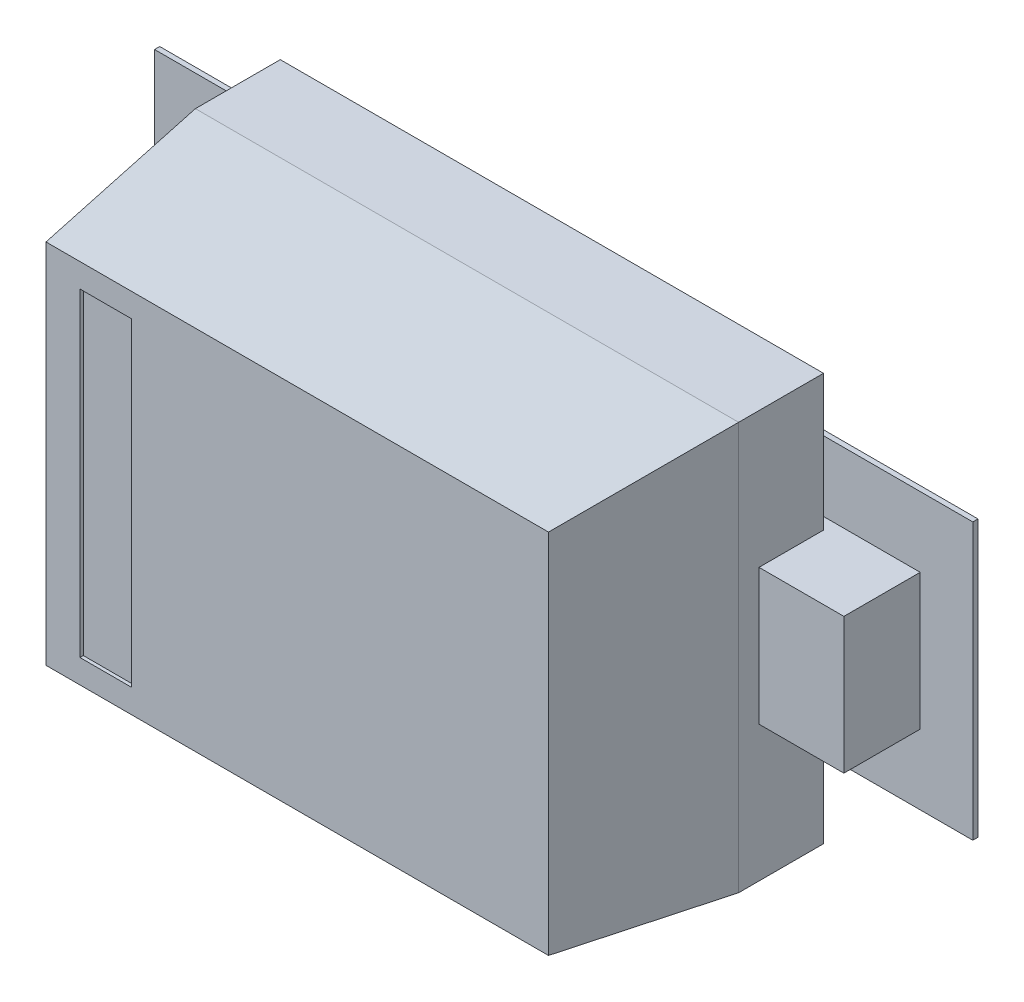
ISO-10303-21;
HEADER;
FILE_DESCRIPTION(('STEP AP214'),'2;1');
FILE_NAME('part.step','',(''),(''),'','','');
FILE_SCHEMA(('AUTOMOTIVE_DESIGN { 1 0 10303 214 1 1 1 1 }'));
ENDSEC;
DATA;
#1=APPLICATION_CONTEXT('core data for automotive mechanical design processes');
#2=APPLICATION_PROTOCOL_DEFINITION('international standard','automotive_design',2000,#1);
#3=PRODUCT_CONTEXT('',#1,'mechanical');
#4=PRODUCT('Part','Part','',(#3));
#5=PRODUCT_RELATED_PRODUCT_CATEGORY('part','',(#4));
#6=PRODUCT_DEFINITION_FORMATION('','',#4);
#7=PRODUCT_DEFINITION_CONTEXT('part definition',#1,'design');
#8=PRODUCT_DEFINITION('design','',#6,#7);
#9=PRODUCT_DEFINITION_SHAPE('','',#8);
#10=(LENGTH_UNIT() NAMED_UNIT(*) SI_UNIT(.MILLI.,.METRE.));
#11=(NAMED_UNIT(*) PLANE_ANGLE_UNIT() SI_UNIT($,.RADIAN.));
#12=(NAMED_UNIT(*) SI_UNIT($,.STERADIAN.) SOLID_ANGLE_UNIT());
#13=UNCERTAINTY_MEASURE_WITH_UNIT(LENGTH_MEASURE(1.E-05),#10,'distance_accuracy_value','');
#14=(GEOMETRIC_REPRESENTATION_CONTEXT(3) GLOBAL_UNCERTAINTY_ASSIGNED_CONTEXT((#13)) GLOBAL_UNIT_ASSIGNED_CONTEXT((#10,
#11,#12)) REPRESENTATION_CONTEXT('',''));
#15=CARTESIAN_POINT('',(0.,0.,0.));
#16=DIRECTION('',(0.,0.,1.));
#17=DIRECTION('',(1.,0.,0.));
#18=AXIS2_PLACEMENT_3D('',#15,#16,#17);
#19=CARTESIAN_POINT('',(-0.525,-0.1,0.0762));
#20=DIRECTION('',(-1.,0.,0.));
#21=DIRECTION('',(0.,0.,1.));
#22=AXIS2_PLACEMENT_3D('',#19,#20,#21);
#23=PLANE('',#22);
#24=DIRECTION('',(0.,0.,1.));
#25=VECTOR('',#24,1.);
#26=CARTESIAN_POINT('',(-0.525,-0.1,0.08382));
#27=LINE('',#26,#25);
#28=CARTESIAN_POINT('',(-0.525,-0.1,0.08382));
#29=VERTEX_POINT('',#28);
#30=CARTESIAN_POINT('',(-0.525,-0.1,0.1962));
#31=VERTEX_POINT('',#30);
#32=EDGE_CURVE('E418',#29,#31,#27,.T.);
#33=ORIENTED_EDGE('',*,*,#32,.T.);
#34=DIRECTION('',(0.,1.,0.));
#35=VECTOR('',#34,1.);
#36=CARTESIAN_POINT('',(-0.525,-0.1,0.1962));
#37=LINE('',#36,#35);
#38=CARTESIAN_POINT('',(-0.525,0.1,0.1962));
#39=VERTEX_POINT('',#38);
#40=EDGE_CURVE('E11',#31,#39,#37,.T.);
#41=ORIENTED_EDGE('',*,*,#40,.T.);
#42=DIRECTION('',(0.,0.,1.));
#43=VECTOR('',#42,1.);
#44=CARTESIAN_POINT('',(-0.525,0.1,0.08382));
#45=LINE('',#44,#43);
#46=CARTESIAN_POINT('',(-0.525,0.1,0.08382));
#47=VERTEX_POINT('',#46);
#48=EDGE_CURVE('E389',#47,#39,#45,.T.);
#49=ORIENTED_EDGE('',*,*,#48,.F.);
#50=DIRECTION('',(0.,1.,0.));
#51=VECTOR('',#50,1.);
#52=CARTESIAN_POINT('',(-0.525,-0.1,0.08382));
#53=LINE('',#52,#51);
#54=EDGE_CURVE('E437',#29,#47,#53,.T.);
#55=ORIENTED_EDGE('',*,*,#54,.F.);
#56=EDGE_LOOP('',(#33,#41,#49,#55));
#57=FACE_BOUND('',#56,.T.);
#58=ADVANCED_FACE('F17',(#57),#23,.T.);
#59=CARTESIAN_POINT('',(-0.525,-0.1,0.1962));
#60=DIRECTION('',(0.,0.,1.));
#61=DIRECTION('',(1.,0.,0.));
#62=AXIS2_PLACEMENT_3D('',#59,#60,#61);
#63=PLANE('',#62);
#64=DIRECTION('',(0.,1.,0.));
#65=VECTOR('',#64,1.);
#66=CARTESIAN_POINT('',(-0.4,-0.1,0.1962));
#67=LINE('',#66,#65);
#68=CARTESIAN_POINT('',(-0.4,-0.1,0.1962));
#69=VERTEX_POINT('',#68);
#70=CARTESIAN_POINT('',(-0.4,0.1,0.1962));
#71=VERTEX_POINT('',#70);
#72=EDGE_CURVE('E317',#69,#71,#67,.T.);
#73=ORIENTED_EDGE('',*,*,#72,.T.);
#74=DIRECTION('',(1.,0.,0.));
#75=VECTOR('',#74,1.);
#76=CARTESIAN_POINT('',(-0.525,0.1,0.1962));
#77=LINE('',#76,#75);
#78=EDGE_CURVE('E273',#39,#71,#77,.T.);
#79=ORIENTED_EDGE('',*,*,#78,.F.);
#80=ORIENTED_EDGE('',*,*,#40,.F.);
#81=DIRECTION('',(1.,0.,0.));
#82=VECTOR('',#81,1.);
#83=CARTESIAN_POINT('',(-0.525,-0.1,0.1962));
#84=LINE('',#83,#82);
#85=EDGE_CURVE('E422',#31,#69,#84,.T.);
#86=ORIENTED_EDGE('',*,*,#85,.T.);
#87=EDGE_LOOP('',(#73,#79,#80,#86));
#88=FACE_BOUND('',#87,.T.);
#89=ADVANCED_FACE('F628',(#88),#63,.T.);
#90=CARTESIAN_POINT('',(-0.325,-0.1,0.1962));
#91=DIRECTION('',(1.,0.,0.));
#92=DIRECTION('',(0.,1.,0.));
#93=AXIS2_PLACEMENT_3D('',#90,#91,#92);
#94=PLANE('',#93);
#95=DIRECTION('',(0.,0.,-1.));
#96=VECTOR('',#95,1.);
#97=CARTESIAN_POINT('',(-0.325,0.1,0.1012));
#98=LINE('',#97,#96);
#99=CARTESIAN_POINT('',(-0.325,0.1,0.1012));
#100=VERTEX_POINT('',#99);
#101=CARTESIAN_POINT('',(-0.325,0.1,0.08382));
#102=VERTEX_POINT('',#101);
#103=EDGE_CURVE('E28',#100,#102,#98,.T.);
#104=ORIENTED_EDGE('',*,*,#103,.F.);
#105=DIRECTION('',(0.,1.,0.));
#106=VECTOR('',#105,1.);
#107=CARTESIAN_POINT('',(-0.325,-0.1,0.1012));
#108=LINE('',#107,#106);
#109=CARTESIAN_POINT('',(-0.325,-0.1,0.1012));
#110=VERTEX_POINT('',#109);
#111=EDGE_CURVE('E267',#110,#100,#108,.T.);
#112=ORIENTED_EDGE('',*,*,#111,.F.);
#113=DIRECTION('',(0.,0.,-1.));
#114=VECTOR('',#113,1.);
#115=CARTESIAN_POINT('',(-0.325,-0.1,0.1012));
#116=LINE('',#115,#114);
#117=CARTESIAN_POINT('',(-0.325,-0.1,0.08382));
#118=VERTEX_POINT('',#117);
#119=EDGE_CURVE('E466',#110,#118,#116,.T.);
#120=ORIENTED_EDGE('',*,*,#119,.T.);
#121=DIRECTION('',(0.,1.,0.));
#122=VECTOR('',#121,1.);
#123=CARTESIAN_POINT('',(-0.325,-0.1,0.08382));
#124=LINE('',#123,#122);
#125=EDGE_CURVE('E268',#118,#102,#124,.T.);
#126=ORIENTED_EDGE('',*,*,#125,.T.);
#127=EDGE_LOOP('',(#104,#112,#120,#126));
#128=FACE_BOUND('',#127,.T.);
#129=ADVANCED_FACE('F264',(#128),#94,.T.);
#130=CARTESIAN_POINT('',(0.325,-0.1,0.0762));
#131=DIRECTION('',(-1.,0.,0.));
#132=DIRECTION('',(0.,0.,1.));
#133=AXIS2_PLACEMENT_3D('',#130,#131,#132);
#134=PLANE('',#133);
#135=DIRECTION('',(0.,0.,1.));
#136=VECTOR('',#135,1.);
#137=CARTESIAN_POINT('',(0.325,-0.1,0.08382));
#138=LINE('',#137,#136);
#139=CARTESIAN_POINT('',(0.325,-0.1,0.08382));
#140=VERTEX_POINT('',#139);
#141=CARTESIAN_POINT('',(0.325,-0.1,0.1012));
#142=VERTEX_POINT('',#141);
#143=EDGE_CURVE('E359',#140,#142,#138,.T.);
#144=ORIENTED_EDGE('',*,*,#143,.T.);
#145=DIRECTION('',(0.,1.,0.));
#146=VECTOR('',#145,1.);
#147=CARTESIAN_POINT('',(0.325,-0.1,0.1012));
#148=LINE('',#147,#146);
#149=CARTESIAN_POINT('',(0.325,0.1,0.1012));
#150=VERTEX_POINT('',#149);
#151=EDGE_CURVE('E506',#142,#150,#148,.T.);
#152=ORIENTED_EDGE('',*,*,#151,.T.);
#153=DIRECTION('',(0.,0.,1.));
#154=VECTOR('',#153,1.);
#155=CARTESIAN_POINT('',(0.325,0.1,0.08382));
#156=LINE('',#155,#154);
#157=CARTESIAN_POINT('',(0.325,0.1,0.08382));
#158=VERTEX_POINT('',#157);
#159=EDGE_CURVE('E312',#158,#150,#156,.T.);
#160=ORIENTED_EDGE('',*,*,#159,.F.);
#161=DIRECTION('',(0.,1.,0.));
#162=VECTOR('',#161,1.);
#163=CARTESIAN_POINT('',(0.325,-0.1,0.08382));
#164=LINE('',#163,#162);
#165=EDGE_CURVE('E377',#140,#158,#164,.T.);
#166=ORIENTED_EDGE('',*,*,#165,.F.);
#167=EDGE_LOOP('',(#144,#152,#160,#166));
#168=FACE_BOUND('',#167,.T.);
#169=ADVANCED_FACE('F640',(#168),#134,.T.);
#170=CARTESIAN_POINT('',(0.,0.1,0.));
#171=DIRECTION('',(0.,1.,0.));
#172=DIRECTION('',(1.,0.,0.));
#173=AXIS2_PLACEMENT_3D('',#170,#171,#172);
#174=PLANE('',#173);
#175=ORIENTED_EDGE('',*,*,#48,.T.);
#176=ORIENTED_EDGE('',*,*,#78,.T.);
#177=DIRECTION('',(0.,0.,1.));
#178=VECTOR('',#177,1.);
#179=CARTESIAN_POINT('',(-0.4,0.1,0.1012));
#180=LINE('',#179,#178);
#181=CARTESIAN_POINT('',(-0.4,0.1,0.1012));
#182=VERTEX_POINT('',#181);
#183=EDGE_CURVE('E280',#182,#71,#180,.T.);
#184=ORIENTED_EDGE('',*,*,#183,.F.);
#185=DIRECTION('',(1.,0.,0.));
#186=VECTOR('',#185,1.);
#187=CARTESIAN_POINT('',(-0.4,0.1,0.1012));
#188=LINE('',#187,#186);
#189=EDGE_CURVE('E276',#182,#100,#188,.T.);
#190=ORIENTED_EDGE('',*,*,#189,.T.);
#191=ORIENTED_EDGE('',*,*,#103,.T.);
#192=DIRECTION('',(-1.,0.,0.));
#193=VECTOR('',#192,1.);
#194=CARTESIAN_POINT('',(-0.325,0.1,0.08382));
#195=LINE('',#194,#193);
#196=EDGE_CURVE('E434',#102,#47,#195,.T.);
#197=ORIENTED_EDGE('',*,*,#196,.T.);
#198=EDGE_LOOP('',(#175,#176,#184,#190,#191,#197));
#199=FACE_BOUND('',#198,.T.);
#200=ADVANCED_FACE('F278',(#199),#174,.T.);
#201=CARTESIAN_POINT('',(0.,0.1,0.));
#202=DIRECTION('',(0.,1.,0.));
#203=DIRECTION('',(1.,0.,0.));
#204=AXIS2_PLACEMENT_3D('',#201,#202,#203);
#205=PLANE('',#204);
#206=ORIENTED_EDGE('',*,*,#159,.T.);
#207=DIRECTION('',(1.,0.,0.));
#208=VECTOR('',#207,1.);
#209=CARTESIAN_POINT('',(0.325,0.1,0.1012));
#210=LINE('',#209,#208);
#211=CARTESIAN_POINT('',(0.4,0.1,0.1012));
#212=VERTEX_POINT('',#211);
#213=EDGE_CURVE('E495',#150,#212,#210,.T.);
#214=ORIENTED_EDGE('',*,*,#213,.T.);
#215=DIRECTION('',(0.,0.,-1.));
#216=VECTOR('',#215,1.);
#217=CARTESIAN_POINT('',(0.4,0.1,0.1962));
#218=LINE('',#217,#216);
#219=CARTESIAN_POINT('',(0.4,0.1,0.1962));
#220=VERTEX_POINT('',#219);
#221=EDGE_CURVE('E427',#220,#212,#218,.T.);
#222=ORIENTED_EDGE('',*,*,#221,.F.);
#223=DIRECTION('',(1.,0.,0.));
#224=VECTOR('',#223,1.);
#225=CARTESIAN_POINT('',(0.4,0.1,0.1962));
#226=LINE('',#225,#224);
#227=CARTESIAN_POINT('',(0.525,0.1,0.1962));
#228=VERTEX_POINT('',#227);
#229=EDGE_CURVE('E449',#220,#228,#226,.T.);
#230=ORIENTED_EDGE('',*,*,#229,.T.);
#231=DIRECTION('',(0.,0.,-1.));
#232=VECTOR('',#231,1.);
#233=CARTESIAN_POINT('',(0.525,0.1,0.1962));
#234=LINE('',#233,#232);
#235=CARTESIAN_POINT('',(0.525,0.1,0.08382));
#236=VERTEX_POINT('',#235);
#237=EDGE_CURVE('E450',#228,#236,#234,.T.);
#238=ORIENTED_EDGE('',*,*,#237,.T.);
#239=DIRECTION('',(-1.,0.,0.));
#240=VECTOR('',#239,1.);
#241=CARTESIAN_POINT('',(0.525,0.1,0.08382));
#242=LINE('',#241,#240);
#243=EDGE_CURVE('E550',#236,#158,#242,.T.);
#244=ORIENTED_EDGE('',*,*,#243,.T.);
#245=EDGE_LOOP('',(#206,#214,#222,#230,#238,#244));
#246=FACE_BOUND('',#245,.T.);
#247=ADVANCED_FACE('F639',(#246),#205,.T.);
#248=CARTESIAN_POINT('',(0.,0.3,0.));
#249=DIRECTION('',(0.,1.,0.));
#250=DIRECTION('',(1.,0.,0.));
#251=AXIS2_PLACEMENT_3D('',#248,#249,#250);
#252=PLANE('',#251);
#253=DIRECTION('',(0.,0.,-1.));
#254=VECTOR('',#253,1.);
#255=CARTESIAN_POINT('',(0.4,0.3,0.2262));
#256=LINE('',#255,#254);
#257=CARTESIAN_POINT('',(0.4,0.3,0.2262));
#258=VERTEX_POINT('',#257);
#259=CARTESIAN_POINT('',(0.4,0.3,0.1012));
#260=VERTEX_POINT('',#259);
#261=EDGE_CURVE('E430',#258,#260,#256,.T.);
#262=ORIENTED_EDGE('',*,*,#261,.T.);
#263=DIRECTION('',(-1.,0.,0.));
#264=VECTOR('',#263,1.);
#265=CARTESIAN_POINT('',(0.4,0.3,0.1012));
#266=LINE('',#265,#264);
#267=CARTESIAN_POINT('',(-0.4,0.3,0.1012));
#268=VERTEX_POINT('',#267);
#269=EDGE_CURVE('E285',#260,#268,#266,.T.);
#270=ORIENTED_EDGE('',*,*,#269,.T.);
#271=DIRECTION('',(0.,0.,1.));
#272=VECTOR('',#271,1.);
#273=CARTESIAN_POINT('',(-0.4,0.3,0.1012));
#274=LINE('',#273,#272);
#275=CARTESIAN_POINT('',(-0.4,0.3,0.2262));
#276=VERTEX_POINT('',#275);
#277=EDGE_CURVE('E321',#268,#276,#274,.T.);
#278=ORIENTED_EDGE('',*,*,#277,.T.);
#279=DIRECTION('',(1.,0.,0.));
#280=VECTOR('',#279,1.);
#281=CARTESIAN_POINT('',(-0.4,0.3,0.2262));
#282=LINE('',#281,#280);
#283=EDGE_CURVE('E218',#276,#258,#282,.T.);
#284=ORIENTED_EDGE('',*,*,#283,.T.);
#285=EDGE_LOOP('',(#262,#270,#278,#284));
#286=FACE_BOUND('',#285,.T.);
#287=ADVANCED_FACE('F672',(#286),#252,.T.);
#288=CARTESIAN_POINT('',(0.,0.285,0.3512));
#289=DIRECTION('',(0.,0.992876838486925,0.119145220618403));
#290=DIRECTION('',(1.,0.,0.));
#291=AXIS2_PLACEMENT_3D('',#288,#289,#290);
#292=PLANE('',#291);
#293=DIRECTION('',(-0.118308451008796,0.118308451008796,-0.985903758406366));
#294=VECTOR('',#293,1.);
#295=CARTESIAN_POINT('',(-0.37,0.27,0.4762));
#296=LINE('',#295,#294);
#297=CARTESIAN_POINT('',(-0.37,0.27,0.4762));
#298=VERTEX_POINT('',#297);
#299=EDGE_CURVE('E413',#298,#276,#296,.T.);
#300=ORIENTED_EDGE('',*,*,#299,.F.);
#301=DIRECTION('',(1.,0.,0.));
#302=VECTOR('',#301,1.);
#303=CARTESIAN_POINT('',(-0.37,0.27,0.4762));
#304=LINE('',#303,#302);
#305=CARTESIAN_POINT('',(0.37,0.27,0.4762));
#306=VERTEX_POINT('',#305);
#307=EDGE_CURVE('E393',#298,#306,#304,.T.);
#308=ORIENTED_EDGE('',*,*,#307,.T.);
#309=DIRECTION('',(0.118308451008796,0.118308451008796,-0.985903758406366));
#310=VECTOR('',#309,1.);
#311=CARTESIAN_POINT('',(0.37,0.27,0.4762));
#312=LINE('',#311,#310);
#313=EDGE_CURVE('E313',#306,#258,#312,.T.);
#314=ORIENTED_EDGE('',*,*,#313,.T.);
#315=ORIENTED_EDGE('',*,*,#283,.F.);
#316=EDGE_LOOP('',(#300,#308,#314,#315));
#317=FACE_BOUND('',#316,.T.);
#318=ADVANCED_FACE('F675',(#317),#292,.T.);
#319=CARTESIAN_POINT('',(0.385,0.,0.3512));
#320=DIRECTION('',(0.992876838486925,0.,0.119145220618403));
#321=DIRECTION('',(0.,-1.,0.));
#322=AXIS2_PLACEMENT_3D('',#319,#320,#321);
#323=PLANE('',#322);
#324=ORIENTED_EDGE('',*,*,#313,.F.);
#325=DIRECTION('',(0.,-1.,0.));
#326=VECTOR('',#325,1.);
#327=CARTESIAN_POINT('',(0.37,0.27,0.4762));
#328=LINE('',#327,#326);
#329=CARTESIAN_POINT('',(0.37,-0.27,0.4762));
#330=VERTEX_POINT('',#329);
#331=EDGE_CURVE('E390',#306,#330,#328,.T.);
#332=ORIENTED_EDGE('',*,*,#331,.T.);
#333=DIRECTION('',(0.118308451008796,-0.118308451008796,-0.985903758406366));
#334=VECTOR('',#333,1.);
#335=CARTESIAN_POINT('',(0.37,-0.27,0.4762));
#336=LINE('',#335,#334);
#337=CARTESIAN_POINT('',(0.4,-0.3,0.2262));
#338=VERTEX_POINT('',#337);
#339=EDGE_CURVE('E332',#330,#338,#336,.T.);
#340=ORIENTED_EDGE('',*,*,#339,.T.);
#341=DIRECTION('',(0.,-1.,0.));
#342=VECTOR('',#341,1.);
#343=CARTESIAN_POINT('',(0.4,0.3,0.2262));
#344=LINE('',#343,#342);
#345=EDGE_CURVE('E451',#258,#338,#344,.T.);
#346=ORIENTED_EDGE('',*,*,#345,.F.);
#347=EDGE_LOOP('',(#324,#332,#340,#346));
#348=FACE_BOUND('',#347,.T.);
#349=ADVANCED_FACE('F654',(#348),#323,.T.);
#350=CARTESIAN_POINT('',(0.4,-0.3,0.4762));
#351=DIRECTION('',(1.,0.,0.));
#352=DIRECTION('',(0.,1.,0.));
#353=AXIS2_PLACEMENT_3D('',#350,#351,#352);
#354=PLANE('',#353);
#355=DIRECTION('',(0.,0.,-1.));
#356=VECTOR('',#355,1.);
#357=CARTESIAN_POINT('',(0.4,-0.3,0.2262));
#358=LINE('',#357,#356);
#359=CARTESIAN_POINT('',(0.4,-0.3,0.1012));
#360=VERTEX_POINT('',#359);
#361=EDGE_CURVE('E322',#338,#360,#358,.T.);
#362=ORIENTED_EDGE('',*,*,#361,.T.);
#363=DIRECTION('',(0.,1.,0.));
#364=VECTOR('',#363,1.);
#365=CARTESIAN_POINT('',(0.4,-0.3,0.1012));
#366=LINE('',#365,#364);
#367=CARTESIAN_POINT('',(0.4,-0.1,0.1012));
#368=VERTEX_POINT('',#367);
#369=EDGE_CURVE('E381',#360,#368,#366,.T.);
#370=ORIENTED_EDGE('',*,*,#369,.T.);
#371=DIRECTION('',(0.,0.,-1.));
#372=VECTOR('',#371,1.);
#373=CARTESIAN_POINT('',(0.4,-0.1,0.1962));
#374=LINE('',#373,#372);
#375=CARTESIAN_POINT('',(0.4,-0.1,0.1962));
#376=VERTEX_POINT('',#375);
#377=EDGE_CURVE('E363',#376,#368,#374,.T.);
#378=ORIENTED_EDGE('',*,*,#377,.F.);
#379=DIRECTION('',(0.,1.,0.));
#380=VECTOR('',#379,1.);
#381=CARTESIAN_POINT('',(0.4,-0.1,0.1962));
#382=LINE('',#381,#380);
#383=EDGE_CURVE('E431',#376,#220,#382,.T.);
#384=ORIENTED_EDGE('',*,*,#383,.T.);
#385=ORIENTED_EDGE('',*,*,#221,.T.);
#386=DIRECTION('',(0.,1.,0.));
#387=VECTOR('',#386,1.);
#388=CARTESIAN_POINT('',(0.4,0.1,0.1012));
#389=LINE('',#388,#387);
#390=EDGE_CURVE('E409',#212,#260,#389,.T.);
#391=ORIENTED_EDGE('',*,*,#390,.T.);
#392=ORIENTED_EDGE('',*,*,#261,.F.);
#393=ORIENTED_EDGE('',*,*,#345,.T.);
#394=EDGE_LOOP('',(#362,#370,#378,#384,#385,#391,#392,#393));
#395=FACE_BOUND('',#394,.T.);
#396=ADVANCED_FACE('F650',(#395),#354,.T.);
#397=CARTESIAN_POINT('',(0.325,-0.1,0.1962));
#398=DIRECTION('',(0.,0.,1.));
#399=DIRECTION('',(1.,0.,0.));
#400=AXIS2_PLACEMENT_3D('',#397,#398,#399);
#401=PLANE('',#400);
#402=DIRECTION('',(0.,1.,0.));
#403=VECTOR('',#402,1.);
#404=CARTESIAN_POINT('',(0.525,-0.1,0.1962));
#405=LINE('',#404,#403);
#406=CARTESIAN_POINT('',(0.525,-0.1,0.1962));
#407=VERTEX_POINT('',#406);
#408=EDGE_CURVE('E445',#407,#228,#405,.T.);
#409=ORIENTED_EDGE('',*,*,#408,.T.);
#410=ORIENTED_EDGE('',*,*,#229,.F.);
#411=ORIENTED_EDGE('',*,*,#383,.F.);
#412=DIRECTION('',(1.,0.,0.));
#413=VECTOR('',#412,1.);
#414=CARTESIAN_POINT('',(0.4,-0.1,0.1962));
#415=LINE('',#414,#413);
#416=EDGE_CURVE('E412',#376,#407,#415,.T.);
#417=ORIENTED_EDGE('',*,*,#416,.T.);
#418=EDGE_LOOP('',(#409,#410,#411,#417));
#419=FACE_BOUND('',#418,.T.);
#420=ADVANCED_FACE('F653',(#419),#401,.T.);
#421=CARTESIAN_POINT('',(0.525,-0.1,0.1962));
#422=DIRECTION('',(1.,0.,0.));
#423=DIRECTION('',(0.,1.,0.));
#424=AXIS2_PLACEMENT_3D('',#421,#422,#423);
#425=PLANE('',#424);
#426=ORIENTED_EDGE('',*,*,#237,.F.);
#427=ORIENTED_EDGE('',*,*,#408,.F.);
#428=DIRECTION('',(0.,0.,-1.));
#429=VECTOR('',#428,1.);
#430=CARTESIAN_POINT('',(0.525,-0.1,0.1962));
#431=LINE('',#430,#429);
#432=CARTESIAN_POINT('',(0.525,-0.1,0.08382));
#433=VERTEX_POINT('',#432);
#434=EDGE_CURVE('E380',#407,#433,#431,.T.);
#435=ORIENTED_EDGE('',*,*,#434,.T.);
#436=DIRECTION('',(0.,1.,0.));
#437=VECTOR('',#436,1.);
#438=CARTESIAN_POINT('',(0.525,-0.1,0.08382));
#439=LINE('',#438,#437);
#440=EDGE_CURVE('E474',#433,#236,#439,.T.);
#441=ORIENTED_EDGE('',*,*,#440,.T.);
#442=EDGE_LOOP('',(#426,#427,#435,#441));
#443=FACE_BOUND('',#442,.T.);
#444=ADVANCED_FACE('F537',(#443),#425,.T.);
#445=CARTESIAN_POINT('',(-0.2975102,-0.2029968,0.0762));
#446=DIRECTION('',(1.,0.,0.));
#447=DIRECTION('',(0.,1.,0.));
#448=AXIS2_PLACEMENT_3D('',#445,#446,#447);
#449=PLANE('',#448);
#450=DIRECTION('',(0.,0.,1.));
#451=VECTOR('',#450,1.);
#452=CARTESIAN_POINT('',(-0.2975102,0.2029968,0.0762));
#453=LINE('',#452,#451);
#454=CARTESIAN_POINT('',(-0.2975102,0.2029968,0.0762));
#455=VERTEX_POINT('',#454);
#456=CARTESIAN_POINT('',(-0.2975102,0.2029968,0.08382));
#457=VERTEX_POINT('',#456);
#458=EDGE_CURVE('E306',#455,#457,#453,.T.);
#459=ORIENTED_EDGE('',*,*,#458,.T.);
#460=DIRECTION('',(0.,1.,0.));
#461=VECTOR('',#460,1.);
#462=CARTESIAN_POINT('',(-0.2975102,-0.2029968,0.08382));
#463=LINE('',#462,#461);
#464=CARTESIAN_POINT('',(-0.2975102,-0.2029968,0.08382));
#465=VERTEX_POINT('',#464);
#466=EDGE_CURVE('E372',#465,#457,#463,.T.);
#467=ORIENTED_EDGE('',*,*,#466,.F.);
#468=DIRECTION('',(0.,0.,1.));
#469=VECTOR('',#468,1.);
#470=CARTESIAN_POINT('',(-0.2975102,-0.2029968,0.0762));
#471=LINE('',#470,#469);
#472=CARTESIAN_POINT('',(-0.2975102,-0.2029968,0.0762));
#473=VERTEX_POINT('',#472);
#474=EDGE_CURVE('E478',#473,#465,#471,.T.);
#475=ORIENTED_EDGE('',*,*,#474,.F.);
#476=DIRECTION('',(0.,1.,0.));
#477=VECTOR('',#476,1.);
#478=CARTESIAN_POINT('',(-0.2975102,-0.2029968,0.0762));
#479=LINE('',#478,#477);
#480=EDGE_CURVE('E351',#473,#455,#479,.T.);
#481=ORIENTED_EDGE('',*,*,#480,.T.);
#482=EDGE_LOOP('',(#459,#467,#475,#481));
#483=FACE_BOUND('',#482,.T.);
#484=ADVANCED_FACE('F709',(#483),#449,.T.);
#485=CARTESIAN_POINT('',(-0.602488,-0.2029968,0.0762));
#486=DIRECTION('',(0.,-1.,0.));
#487=DIRECTION('',(0.,0.,-1.));
#488=AXIS2_PLACEMENT_3D('',#485,#486,#487);
#489=PLANE('',#488);
#490=ORIENTED_EDGE('',*,*,#474,.T.);
#491=DIRECTION('',(1.,0.,0.));
#492=VECTOR('',#491,1.);
#493=CARTESIAN_POINT('',(-0.602488,-0.2029968,0.08382));
#494=LINE('',#493,#492);
#495=CARTESIAN_POINT('',(-0.602488,-0.2029968,0.08382));
#496=VERTEX_POINT('',#495);
#497=EDGE_CURVE('E368',#496,#465,#494,.T.);
#498=ORIENTED_EDGE('',*,*,#497,.F.);
#499=DIRECTION('',(0.,0.,1.));
#500=VECTOR('',#499,1.);
#501=CARTESIAN_POINT('',(-0.602488,-0.2029968,0.0762));
#502=LINE('',#501,#500);
#503=CARTESIAN_POINT('',(-0.602488,-0.2029968,0.0762));
#504=VERTEX_POINT('',#503);
#505=EDGE_CURVE('E481',#504,#496,#502,.T.);
#506=ORIENTED_EDGE('',*,*,#505,.F.);
#507=DIRECTION('',(1.,0.,0.));
#508=VECTOR('',#507,1.);
#509=CARTESIAN_POINT('',(-0.602488,-0.2029968,0.0762));
#510=LINE('',#509,#508);
#511=EDGE_CURVE('E498',#504,#473,#510,.T.);
#512=ORIENTED_EDGE('',*,*,#511,.T.);
#513=EDGE_LOOP('',(#490,#498,#506,#512));
#514=FACE_BOUND('',#513,.T.);
#515=ADVANCED_FACE('F679',(#514),#489,.T.);
#516=CARTESIAN_POINT('',(-0.602488,0.2029968,0.0762));
#517=DIRECTION('',(-1.,0.,0.));
#518=DIRECTION('',(0.,0.,1.));
#519=AXIS2_PLACEMENT_3D('',#516,#517,#518);
#520=PLANE('',#519);
#521=ORIENTED_EDGE('',*,*,#505,.T.);
#522=DIRECTION('',(0.,-1.,0.));
#523=VECTOR('',#522,1.);
#524=CARTESIAN_POINT('',(-0.602488,0.2029968,0.08382));
#525=LINE('',#524,#523);
#526=CARTESIAN_POINT('',(-0.602488,0.2029968,0.08382));
#527=VERTEX_POINT('',#526);
#528=EDGE_CURVE('E373',#527,#496,#525,.T.);
#529=ORIENTED_EDGE('',*,*,#528,.F.);
#530=DIRECTION('',(0.,0.,1.));
#531=VECTOR('',#530,1.);
#532=CARTESIAN_POINT('',(-0.602488,0.2029968,0.0762));
#533=LINE('',#532,#531);
#534=CARTESIAN_POINT('',(-0.602488,0.2029968,0.0762));
#535=VERTEX_POINT('',#534);
#536=EDGE_CURVE('E309',#535,#527,#533,.T.);
#537=ORIENTED_EDGE('',*,*,#536,.F.);
#538=DIRECTION('',(0.,-1.,0.));
#539=VECTOR('',#538,1.);
#540=CARTESIAN_POINT('',(-0.602488,0.2029968,0.0762));
#541=LINE('',#540,#539);
#542=EDGE_CURVE('E499',#535,#504,#541,.T.);
#543=ORIENTED_EDGE('',*,*,#542,.T.);
#544=EDGE_LOOP('',(#521,#529,#537,#543));
#545=FACE_BOUND('',#544,.T.);
#546=ADVANCED_FACE('F659',(#545),#520,.T.);
#547=CARTESIAN_POINT('',(0.2975102,0.2029968,0.0762));
#548=DIRECTION('',(-1.,0.,0.));
#549=DIRECTION('',(0.,0.,1.));
#550=AXIS2_PLACEMENT_3D('',#547,#548,#549);
#551=PLANE('',#550);
#552=DIRECTION('',(0.,0.,1.));
#553=VECTOR('',#552,1.);
#554=CARTESIAN_POINT('',(0.2975102,-0.2029968,0.0762));
#555=LINE('',#554,#553);
#556=CARTESIAN_POINT('',(0.2975102,-0.2029968,0.0762));
#557=VERTEX_POINT('',#556);
#558=CARTESIAN_POINT('',(0.2975102,-0.2029968,0.08382));
#559=VERTEX_POINT('',#558);
#560=EDGE_CURVE('E581',#557,#559,#555,.T.);
#561=ORIENTED_EDGE('',*,*,#560,.T.);
#562=DIRECTION('',(0.,-1.,0.));
#563=VECTOR('',#562,1.);
#564=CARTESIAN_POINT('',(0.2975102,0.2029968,0.08382));
#565=LINE('',#564,#563);
#566=CARTESIAN_POINT('',(0.2975102,0.2029968,0.08382));
#567=VERTEX_POINT('',#566);
#568=EDGE_CURVE('E340',#567,#559,#565,.T.);
#569=ORIENTED_EDGE('',*,*,#568,.F.);
#570=DIRECTION('',(0.,0.,1.));
#571=VECTOR('',#570,1.);
#572=CARTESIAN_POINT('',(0.2975102,0.2029968,0.0762));
#573=LINE('',#572,#571);
#574=CARTESIAN_POINT('',(0.2975102,0.2029968,0.0762));
#575=VERTEX_POINT('',#574);
#576=EDGE_CURVE('E356',#575,#567,#573,.T.);
#577=ORIENTED_EDGE('',*,*,#576,.F.);
#578=DIRECTION('',(0.,-1.,0.));
#579=VECTOR('',#578,1.);
#580=CARTESIAN_POINT('',(0.2975102,0.2029968,0.0762));
#581=LINE('',#580,#579);
#582=EDGE_CURVE('E21',#575,#557,#581,.T.);
#583=ORIENTED_EDGE('',*,*,#582,.T.);
#584=EDGE_LOOP('',(#561,#569,#577,#583));
#585=FACE_BOUND('',#584,.T.);
#586=ADVANCED_FACE('F656',(#585),#551,.T.);
#587=CARTESIAN_POINT('',(0.2975102,-0.2029968,0.0762));
#588=DIRECTION('',(0.,-1.,0.));
#589=DIRECTION('',(0.,0.,-1.));
#590=AXIS2_PLACEMENT_3D('',#587,#588,#589);
#591=PLANE('',#590);
#592=DIRECTION('',(0.,0.,1.));
#593=VECTOR('',#592,1.);
#594=CARTESIAN_POINT('',(0.602488,-0.2029968,0.0762));
#595=LINE('',#594,#593);
#596=CARTESIAN_POINT('',(0.602488,-0.2029968,0.0762));
#597=VERTEX_POINT('',#596);
#598=CARTESIAN_POINT('',(0.602488,-0.2029968,0.08382));
#599=VERTEX_POINT('',#598);
#600=EDGE_CURVE('E355',#597,#599,#595,.T.);
#601=ORIENTED_EDGE('',*,*,#600,.T.);
#602=DIRECTION('',(1.,0.,0.));
#603=VECTOR('',#602,1.);
#604=CARTESIAN_POINT('',(0.2975102,-0.2029968,0.08382));
#605=LINE('',#604,#603);
#606=EDGE_CURVE('E336',#559,#599,#605,.T.);
#607=ORIENTED_EDGE('',*,*,#606,.F.);
#608=ORIENTED_EDGE('',*,*,#560,.F.);
#609=DIRECTION('',(1.,0.,0.));
#610=VECTOR('',#609,1.);
#611=CARTESIAN_POINT('',(0.2975102,-0.2029968,0.0762));
#612=LINE('',#611,#610);
#613=EDGE_CURVE('E386',#557,#597,#612,.T.);
#614=ORIENTED_EDGE('',*,*,#613,.T.);
#615=EDGE_LOOP('',(#601,#607,#608,#614));
#616=FACE_BOUND('',#615,.T.);
#617=ADVANCED_FACE('F647',(#616),#591,.T.);
#618=CARTESIAN_POINT('',(0.602488,-0.2029968,0.0762));
#619=DIRECTION('',(1.,0.,0.));
#620=DIRECTION('',(0.,1.,0.));
#621=AXIS2_PLACEMENT_3D('',#618,#619,#620);
#622=PLANE('',#621);
#623=DIRECTION('',(0.,0.,1.));
#624=VECTOR('',#623,1.);
#625=CARTESIAN_POINT('',(0.602488,0.2029968,0.0762));
#626=LINE('',#625,#624);
#627=CARTESIAN_POINT('',(0.602488,0.2029968,0.0762));
#628=VERTEX_POINT('',#627);
#629=CARTESIAN_POINT('',(0.602488,0.2029968,0.08382));
#630=VERTEX_POINT('',#629);
#631=EDGE_CURVE('E352',#628,#630,#626,.T.);
#632=ORIENTED_EDGE('',*,*,#631,.T.);
#633=DIRECTION('',(0.,1.,0.));
#634=VECTOR('',#633,1.);
#635=CARTESIAN_POINT('',(0.602488,-0.2029968,0.08382));
#636=LINE('',#635,#634);
#637=EDGE_CURVE('E339',#599,#630,#636,.T.);
#638=ORIENTED_EDGE('',*,*,#637,.F.);
#639=ORIENTED_EDGE('',*,*,#600,.F.);
#640=DIRECTION('',(0.,1.,0.));
#641=VECTOR('',#640,1.);
#642=CARTESIAN_POINT('',(0.602488,-0.2029968,0.0762));
#643=LINE('',#642,#641);
#644=EDGE_CURVE('E382',#597,#628,#643,.T.);
#645=ORIENTED_EDGE('',*,*,#644,.T.);
#646=EDGE_LOOP('',(#632,#638,#639,#645));
#647=FACE_BOUND('',#646,.T.);
#648=ADVANCED_FACE('F644',(#647),#622,.T.);
#649=CARTESIAN_POINT('',(0.602488,0.2029968,0.0762));
#650=DIRECTION('',(0.,1.,0.));
#651=DIRECTION('',(1.,0.,0.));
#652=AXIS2_PLACEMENT_3D('',#649,#650,#651);
#653=PLANE('',#652);
#654=ORIENTED_EDGE('',*,*,#576,.T.);
#655=DIRECTION('',(-1.,0.,0.));
#656=VECTOR('',#655,1.);
#657=CARTESIAN_POINT('',(0.602488,0.2029968,0.08382));
#658=LINE('',#657,#656);
#659=EDGE_CURVE('E367',#630,#567,#658,.T.);
#660=ORIENTED_EDGE('',*,*,#659,.F.);
#661=ORIENTED_EDGE('',*,*,#631,.F.);
#662=DIRECTION('',(-1.,0.,0.));
#663=VECTOR('',#662,1.);
#664=CARTESIAN_POINT('',(0.602488,0.2029968,0.0762));
#665=LINE('',#664,#663);
#666=EDGE_CURVE('E347',#628,#575,#665,.T.);
#667=ORIENTED_EDGE('',*,*,#666,.T.);
#668=EDGE_LOOP('',(#654,#660,#661,#667));
#669=FACE_BOUND('',#668,.T.);
#670=ADVANCED_FACE('F646',(#669),#653,.T.);
#671=CARTESIAN_POINT('',(-0.325,-0.1,0.0762));
#672=DIRECTION('',(0.,0.,-1.));
#673=DIRECTION('',(0.,-1.,0.));
#674=AXIS2_PLACEMENT_3D('',#671,#672,#673);
#675=PLANE('',#674);
#676=ORIENTED_EDGE('',*,*,#480,.F.);
#677=ORIENTED_EDGE('',*,*,#511,.F.);
#678=ORIENTED_EDGE('',*,*,#542,.F.);
#679=DIRECTION('',(-1.,0.,0.));
#680=VECTOR('',#679,1.);
#681=CARTESIAN_POINT('',(-0.2975102,0.2029968,0.0762));
#682=LINE('',#681,#680);
#683=EDGE_CURVE('E308',#455,#535,#682,.T.);
#684=ORIENTED_EDGE('',*,*,#683,.F.);
#685=EDGE_LOOP('',(#676,#677,#678,#684));
#686=FACE_BOUND('',#685,.T.);
#687=ADVANCED_FACE('F690',(#686),#675,.T.);
#688=CARTESIAN_POINT('',(-0.325,-0.1,0.0762));
#689=DIRECTION('',(0.,0.,-1.));
#690=DIRECTION('',(0.,-1.,0.));
#691=AXIS2_PLACEMENT_3D('',#688,#689,#690);
#692=PLANE('',#691);
#693=ORIENTED_EDGE('',*,*,#644,.F.);
#694=ORIENTED_EDGE('',*,*,#613,.F.);
#695=ORIENTED_EDGE('',*,*,#582,.F.);
#696=ORIENTED_EDGE('',*,*,#666,.F.);
#697=EDGE_LOOP('',(#693,#694,#695,#696));
#698=FACE_BOUND('',#697,.T.);
#699=ADVANCED_FACE('F686',(#698),#692,.T.);
#700=CARTESIAN_POINT('',(-0.2975102,0.2029968,0.0762));
#701=DIRECTION('',(0.,1.,0.));
#702=DIRECTION('',(1.,0.,0.));
#703=AXIS2_PLACEMENT_3D('',#700,#701,#702);
#704=PLANE('',#703);
#705=ORIENTED_EDGE('',*,*,#536,.T.);
#706=DIRECTION('',(-1.,0.,0.));
#707=VECTOR('',#706,1.);
#708=CARTESIAN_POINT('',(-0.2975102,0.2029968,0.08382));
#709=LINE('',#708,#707);
#710=EDGE_CURVE('E510',#457,#527,#709,.T.);
#711=ORIENTED_EDGE('',*,*,#710,.F.);
#712=ORIENTED_EDGE('',*,*,#458,.F.);
#713=ORIENTED_EDGE('',*,*,#683,.T.);
#714=EDGE_LOOP('',(#705,#711,#712,#713));
#715=FACE_BOUND('',#714,.T.);
#716=ADVANCED_FACE('F683',(#715),#704,.T.);
#717=CARTESIAN_POINT('',(0.,0.,0.08382));
#718=DIRECTION('',(0.,0.,1.));
#719=DIRECTION('',(1.,0.,0.));
#720=AXIS2_PLACEMENT_3D('',#717,#718,#719);
#721=PLANE('',#720);
#722=ORIENTED_EDGE('',*,*,#165,.T.);
#723=ORIENTED_EDGE('',*,*,#243,.F.);
#724=ORIENTED_EDGE('',*,*,#440,.F.);
#725=DIRECTION('',(-1.,0.,0.));
#726=VECTOR('',#725,1.);
#727=CARTESIAN_POINT('',(0.525,-0.1,0.08382));
#728=LINE('',#727,#726);
#729=EDGE_CURVE('E362',#433,#140,#728,.T.);
#730=ORIENTED_EDGE('',*,*,#729,.T.);
#731=EDGE_LOOP('',(#722,#723,#724,#730));
#732=FACE_BOUND('',#731,.T.);
#733=ORIENTED_EDGE('',*,*,#568,.T.);
#734=ORIENTED_EDGE('',*,*,#606,.T.);
#735=ORIENTED_EDGE('',*,*,#637,.T.);
#736=ORIENTED_EDGE('',*,*,#659,.T.);
#737=EDGE_LOOP('',(#733,#734,#735,#736));
#738=FACE_BOUND('',#737,.T.);
#739=ADVANCED_FACE('F547',(#732,#738),#721,.T.);
#740=CARTESIAN_POINT('',(0.,0.,0.08382));
#741=DIRECTION('',(0.,0.,1.));
#742=DIRECTION('',(1.,0.,0.));
#743=AXIS2_PLACEMENT_3D('',#740,#741,#742);
#744=PLANE('',#743);
#745=ORIENTED_EDGE('',*,*,#54,.T.);
#746=ORIENTED_EDGE('',*,*,#196,.F.);
#747=ORIENTED_EDGE('',*,*,#125,.F.);
#748=DIRECTION('',(-1.,0.,0.));
#749=VECTOR('',#748,1.);
#750=CARTESIAN_POINT('',(-0.325,-0.1,0.08382));
#751=LINE('',#750,#749);
#752=EDGE_CURVE('E421',#118,#29,#751,.T.);
#753=ORIENTED_EDGE('',*,*,#752,.T.);
#754=EDGE_LOOP('',(#745,#746,#747,#753));
#755=FACE_BOUND('',#754,.T.);
#756=ORIENTED_EDGE('',*,*,#528,.T.);
#757=ORIENTED_EDGE('',*,*,#497,.T.);
#758=ORIENTED_EDGE('',*,*,#466,.T.);
#759=ORIENTED_EDGE('',*,*,#710,.T.);
#760=EDGE_LOOP('',(#756,#757,#758,#759));
#761=FACE_BOUND('',#760,.T.);
#762=ADVANCED_FACE('F661',(#755,#761),#744,.T.);
#763=CARTESIAN_POINT('',(0.,-0.1,0.));
#764=DIRECTION('',(0.,1.,0.));
#765=DIRECTION('',(1.,0.,0.));
#766=AXIS2_PLACEMENT_3D('',#763,#764,#765);
#767=PLANE('',#766);
#768=ORIENTED_EDGE('',*,*,#119,.F.);
#769=DIRECTION('',(1.,0.,0.));
#770=VECTOR('',#769,1.);
#771=CARTESIAN_POINT('',(-0.4,-0.1,0.1012));
#772=LINE('',#771,#770);
#773=CARTESIAN_POINT('',(-0.4,-0.1,0.1012));
#774=VERTEX_POINT('',#773);
#775=EDGE_CURVE('E290',#774,#110,#772,.T.);
#776=ORIENTED_EDGE('',*,*,#775,.F.);
#777=DIRECTION('',(0.,0.,1.));
#778=VECTOR('',#777,1.);
#779=CARTESIAN_POINT('',(-0.4,-0.1,0.1012));
#780=LINE('',#779,#778);
#781=EDGE_CURVE('E300',#774,#69,#780,.T.);
#782=ORIENTED_EDGE('',*,*,#781,.T.);
#783=ORIENTED_EDGE('',*,*,#85,.F.);
#784=ORIENTED_EDGE('',*,*,#32,.F.);
#785=ORIENTED_EDGE('',*,*,#752,.F.);
#786=EDGE_LOOP('',(#768,#776,#782,#783,#784,#785));
#787=FACE_BOUND('',#786,.T.);
#788=ADVANCED_FACE('F664',(#787),#767,.F.);
#789=CARTESIAN_POINT('',(0.,-0.1,0.));
#790=DIRECTION('',(0.,1.,0.));
#791=DIRECTION('',(1.,0.,0.));
#792=AXIS2_PLACEMENT_3D('',#789,#790,#791);
#793=PLANE('',#792);
#794=ORIENTED_EDGE('',*,*,#434,.F.);
#795=ORIENTED_EDGE('',*,*,#416,.F.);
#796=ORIENTED_EDGE('',*,*,#377,.T.);
#797=DIRECTION('',(1.,0.,0.));
#798=VECTOR('',#797,1.);
#799=CARTESIAN_POINT('',(0.325,-0.1,0.1012));
#800=LINE('',#799,#798);
#801=EDGE_CURVE('E426',#142,#368,#800,.T.);
#802=ORIENTED_EDGE('',*,*,#801,.F.);
#803=ORIENTED_EDGE('',*,*,#143,.F.);
#804=ORIENTED_EDGE('',*,*,#729,.F.);
#805=EDGE_LOOP('',(#794,#795,#796,#802,#803,#804));
#806=FACE_BOUND('',#805,.T.);
#807=ADVANCED_FACE('F542',(#806),#793,.F.);
#808=CARTESIAN_POINT('',(-0.41,-0.3302,0.1012));
#809=DIRECTION('',(0.,0.,1.));
#810=DIRECTION('',(1.,0.,0.));
#811=AXIS2_PLACEMENT_3D('',#808,#809,#810);
#812=PLANE('',#811);
#813=ORIENTED_EDGE('',*,*,#111,.T.);
#814=ORIENTED_EDGE('',*,*,#189,.F.);
#815=DIRECTION('',(0.,1.,0.));
#816=VECTOR('',#815,1.);
#817=CARTESIAN_POINT('',(-0.4,0.1,0.1012));
#818=LINE('',#817,#816);
#819=EDGE_CURVE('E318',#182,#268,#818,.T.);
#820=ORIENTED_EDGE('',*,*,#819,.T.);
#821=ORIENTED_EDGE('',*,*,#269,.F.);
#822=ORIENTED_EDGE('',*,*,#390,.F.);
#823=ORIENTED_EDGE('',*,*,#213,.F.);
#824=ORIENTED_EDGE('',*,*,#151,.F.);
#825=ORIENTED_EDGE('',*,*,#801,.T.);
#826=ORIENTED_EDGE('',*,*,#369,.F.);
#827=DIRECTION('',(-1.,0.,0.));
#828=VECTOR('',#827,1.);
#829=CARTESIAN_POINT('',(0.4,-0.3,0.1012));
#830=LINE('',#829,#828);
#831=CARTESIAN_POINT('',(-0.4,-0.3,0.1012));
#832=VERTEX_POINT('',#831);
#833=EDGE_CURVE('E327',#360,#832,#830,.T.);
#834=ORIENTED_EDGE('',*,*,#833,.T.);
#835=DIRECTION('',(0.,1.,0.));
#836=VECTOR('',#835,1.);
#837=CARTESIAN_POINT('',(-0.4,-0.3,0.1012));
#838=LINE('',#837,#836);
#839=EDGE_CURVE('E292',#832,#774,#838,.T.);
#840=ORIENTED_EDGE('',*,*,#839,.T.);
#841=ORIENTED_EDGE('',*,*,#775,.T.);
#842=EDGE_LOOP('',(#813,#814,#820,#821,#822,#823,#824,#825,#826,#834,#840,#841));
#843=FACE_BOUND('',#842,.T.);
#844=ADVANCED_FACE('F288',(#843),#812,.F.);
#845=CARTESIAN_POINT('',(-0.4,-0.3,0.0762));
#846=DIRECTION('',(-1.,0.,0.));
#847=DIRECTION('',(0.,0.,1.));
#848=AXIS2_PLACEMENT_3D('',#845,#846,#847);
#849=PLANE('',#848);
#850=DIRECTION('',(0.,-1.,0.));
#851=VECTOR('',#850,1.);
#852=CARTESIAN_POINT('',(-0.4,0.3,0.2262));
#853=LINE('',#852,#851);
#854=CARTESIAN_POINT('',(-0.4,-0.3,0.2262));
#855=VERTEX_POINT('',#854);
#856=EDGE_CURVE('E417',#276,#855,#853,.T.);
#857=ORIENTED_EDGE('',*,*,#856,.F.);
#858=ORIENTED_EDGE('',*,*,#277,.F.);
#859=ORIENTED_EDGE('',*,*,#819,.F.);
#860=ORIENTED_EDGE('',*,*,#183,.T.);
#861=ORIENTED_EDGE('',*,*,#72,.F.);
#862=ORIENTED_EDGE('',*,*,#781,.F.);
#863=ORIENTED_EDGE('',*,*,#839,.F.);
#864=DIRECTION('',(0.,0.,1.));
#865=VECTOR('',#864,1.);
#866=CARTESIAN_POINT('',(-0.4,-0.3,0.1012));
#867=LINE('',#866,#865);
#868=EDGE_CURVE('E460',#832,#855,#867,.T.);
#869=ORIENTED_EDGE('',*,*,#868,.T.);
#870=EDGE_LOOP('',(#857,#858,#859,#860,#861,#862,#863,#869));
#871=FACE_BOUND('',#870,.T.);
#872=ADVANCED_FACE('F697',(#871),#849,.T.);
#873=CARTESIAN_POINT('',(-0.385,0.,0.3512));
#874=DIRECTION('',(-0.992876838486925,0.,0.119145220618403));
#875=DIRECTION('',(0.,1.,0.));
#876=AXIS2_PLACEMENT_3D('',#873,#874,#875);
#877=PLANE('',#876);
#878=DIRECTION('',(0.,-1.,0.));
#879=VECTOR('',#878,1.);
#880=CARTESIAN_POINT('',(-0.37,0.27,0.4762));
#881=LINE('',#880,#879);
#882=CARTESIAN_POINT('',(-0.37,-0.27,0.4762));
#883=VERTEX_POINT('',#882);
#884=EDGE_CURVE('E398',#298,#883,#881,.T.);
#885=ORIENTED_EDGE('',*,*,#884,.F.);
#886=ORIENTED_EDGE('',*,*,#299,.T.);
#887=ORIENTED_EDGE('',*,*,#856,.T.);
#888=DIRECTION('',(0.118308451008796,0.118308451008796,0.985903758406366));
#889=VECTOR('',#888,1.);
#890=CARTESIAN_POINT('',(-0.4,-0.3,0.2262));
#891=LINE('',#890,#889);
#892=EDGE_CURVE('E328',#855,#883,#891,.T.);
#893=ORIENTED_EDGE('',*,*,#892,.T.);
#894=EDGE_LOOP('',(#885,#886,#887,#893));
#895=FACE_BOUND('',#894,.T.);
#896=ADVANCED_FACE('F643',(#895),#877,.T.);
#897=CARTESIAN_POINT('',(0.,-0.3,0.4712));
#898=DIRECTION('',(0.,0.,1.));
#899=DIRECTION('',(1.,0.,0.));
#900=AXIS2_PLACEMENT_3D('',#897,#898,#899);
#901=PLANE('',#900);
#902=DIRECTION('',(-1.,0.,0.));
#903=VECTOR('',#902,1.);
#904=CARTESIAN_POINT('',(-0.2438,0.235,0.4712));
#905=LINE('',#904,#903);
#906=CARTESIAN_POINT('',(-0.2438,0.235,0.4712));
#907=VERTEX_POINT('',#906);
#908=CARTESIAN_POINT('',(-0.32,0.235,0.4712));
#909=VERTEX_POINT('',#908);
#910=EDGE_CURVE('E230',#907,#909,#905,.T.);
#911=ORIENTED_EDGE('',*,*,#910,.T.);
#912=DIRECTION('',(0.,-1.,0.));
#913=VECTOR('',#912,1.);
#914=CARTESIAN_POINT('',(-0.32,0.235,0.4712));
#915=LINE('',#914,#913);
#916=CARTESIAN_POINT('',(-0.32,-0.235,0.4712));
#917=VERTEX_POINT('',#916);
#918=EDGE_CURVE('E438',#909,#917,#915,.T.);
#919=ORIENTED_EDGE('',*,*,#918,.T.);
#920=DIRECTION('',(1.,0.,0.));
#921=VECTOR('',#920,1.);
#922=CARTESIAN_POINT('',(-0.32,-0.235,0.4712));
#923=LINE('',#922,#921);
#924=CARTESIAN_POINT('',(-0.2438,-0.235,0.4712));
#925=VERTEX_POINT('',#924);
#926=EDGE_CURVE('E304',#917,#925,#923,.T.);
#927=ORIENTED_EDGE('',*,*,#926,.T.);
#928=DIRECTION('',(0.,1.,0.));
#929=VECTOR('',#928,1.);
#930=CARTESIAN_POINT('',(-0.2438,-0.235,0.4712));
#931=LINE('',#930,#929);
#932=EDGE_CURVE('E346',#925,#907,#931,.T.);
#933=ORIENTED_EDGE('',*,*,#932,.T.);
#934=EDGE_LOOP('',(#911,#919,#927,#933));
#935=FACE_BOUND('',#934,.T.);
#936=ADVANCED_FACE('F599',(#935),#901,.T.);
#937=CARTESIAN_POINT('',(-0.2438,0.235,0.4762));
#938=DIRECTION('',(0.,1.,0.));
#939=DIRECTION('',(1.,0.,0.));
#940=AXIS2_PLACEMENT_3D('',#937,#938,#939);
#941=PLANE('',#940);
#942=DIRECTION('',(0.,0.,-1.));
#943=VECTOR('',#942,1.);
#944=CARTESIAN_POINT('',(-0.32,0.235,0.4762));
#945=LINE('',#944,#943);
#946=CARTESIAN_POINT('',(-0.32,0.235,0.4762));
#947=VERTEX_POINT('',#946);
#948=EDGE_CURVE('E441',#947,#909,#945,.T.);
#949=ORIENTED_EDGE('',*,*,#948,.T.);
#950=ORIENTED_EDGE('',*,*,#910,.F.);
#951=DIRECTION('',(0.,0.,-1.));
#952=VECTOR('',#951,1.);
#953=CARTESIAN_POINT('',(-0.2438,0.235,0.4762));
#954=LINE('',#953,#952);
#955=CARTESIAN_POINT('',(-0.2438,0.235,0.4762));
#956=VERTEX_POINT('',#955);
#957=EDGE_CURVE('E521',#956,#907,#954,.T.);
#958=ORIENTED_EDGE('',*,*,#957,.F.);
#959=DIRECTION('',(-1.,0.,0.));
#960=VECTOR('',#959,1.);
#961=CARTESIAN_POINT('',(-0.2438,0.235,0.4762));
#962=LINE('',#961,#960);
#963=EDGE_CURVE('E406',#956,#947,#962,.T.);
#964=ORIENTED_EDGE('',*,*,#963,.T.);
#965=EDGE_LOOP('',(#949,#950,#958,#964));
#966=FACE_BOUND('',#965,.T.);
#967=ADVANCED_FACE('F612',(#966),#941,.F.);
#968=CARTESIAN_POINT('',(-0.32,0.235,0.4762));
#969=DIRECTION('',(-1.,0.,0.));
#970=DIRECTION('',(0.,0.,1.));
#971=AXIS2_PLACEMENT_3D('',#968,#969,#970);
#972=PLANE('',#971);
#973=DIRECTION('',(0.,0.,-1.));
#974=VECTOR('',#973,1.);
#975=CARTESIAN_POINT('',(-0.32,-0.235,0.4762));
#976=LINE('',#975,#974);
#977=CARTESIAN_POINT('',(-0.32,-0.235,0.4762));
#978=VERTEX_POINT('',#977);
#979=EDGE_CURVE('E442',#978,#917,#976,.T.);
#980=ORIENTED_EDGE('',*,*,#979,.T.);
#981=ORIENTED_EDGE('',*,*,#918,.F.);
#982=ORIENTED_EDGE('',*,*,#948,.F.);
#983=DIRECTION('',(0.,-1.,0.));
#984=VECTOR('',#983,1.);
#985=CARTESIAN_POINT('',(-0.32,0.235,0.4762));
#986=LINE('',#985,#984);
#987=EDGE_CURVE('E402',#947,#978,#986,.T.);
#988=ORIENTED_EDGE('',*,*,#987,.T.);
#989=EDGE_LOOP('',(#980,#981,#982,#988));
#990=FACE_BOUND('',#989,.T.);
#991=ADVANCED_FACE('F614',(#990),#972,.F.);
#992=CARTESIAN_POINT('',(-0.32,-0.235,0.4762));
#993=DIRECTION('',(0.,-1.,0.));
#994=DIRECTION('',(0.,0.,-1.));
#995=AXIS2_PLACEMENT_3D('',#992,#993,#994);
#996=PLANE('',#995);
#997=DIRECTION('',(0.,0.,-1.));
#998=VECTOR('',#997,1.);
#999=CARTESIAN_POINT('',(-0.2438,-0.235,0.4762));
#1000=LINE('',#999,#998);
#1001=CARTESIAN_POINT('',(-0.2438,-0.235,0.4762));
#1002=VERTEX_POINT('',#1001);
#1003=EDGE_CURVE('E342',#1002,#925,#1000,.T.);
#1004=ORIENTED_EDGE('',*,*,#1003,.T.);
#1005=ORIENTED_EDGE('',*,*,#926,.F.);
#1006=ORIENTED_EDGE('',*,*,#979,.F.);
#1007=DIRECTION('',(1.,0.,0.));
#1008=VECTOR('',#1007,1.);
#1009=CARTESIAN_POINT('',(-0.32,-0.235,0.4762));
#1010=LINE('',#1009,#1008);
#1011=EDGE_CURVE('E401',#978,#1002,#1010,.T.);
#1012=ORIENTED_EDGE('',*,*,#1011,.T.);
#1013=EDGE_LOOP('',(#1004,#1005,#1006,#1012));
#1014=FACE_BOUND('',#1013,.T.);
#1015=ADVANCED_FACE('F604',(#1014),#996,.F.);
#1016=CARTESIAN_POINT('',(-0.2438,-0.235,0.4762));
#1017=DIRECTION('',(1.,0.,0.));
#1018=DIRECTION('',(0.,1.,0.));
#1019=AXIS2_PLACEMENT_3D('',#1016,#1017,#1018);
#1020=PLANE('',#1019);
#1021=ORIENTED_EDGE('',*,*,#957,.T.);
#1022=ORIENTED_EDGE('',*,*,#932,.F.);
#1023=ORIENTED_EDGE('',*,*,#1003,.F.);
#1024=DIRECTION('',(0.,1.,0.));
#1025=VECTOR('',#1024,1.);
#1026=CARTESIAN_POINT('',(-0.2438,-0.235,0.4762));
#1027=LINE('',#1026,#1025);
#1028=EDGE_CURVE('E527',#1002,#956,#1027,.T.);
#1029=ORIENTED_EDGE('',*,*,#1028,.T.);
#1030=EDGE_LOOP('',(#1021,#1022,#1023,#1029));
#1031=FACE_BOUND('',#1030,.T.);
#1032=ADVANCED_FACE('F609',(#1031),#1020,.F.);
#1033=CARTESIAN_POINT('',(-0.4,-0.3,0.4762));
#1034=DIRECTION('',(0.,0.,1.));
#1035=DIRECTION('',(1.,0.,0.));
#1036=AXIS2_PLACEMENT_3D('',#1033,#1034,#1035);
#1037=PLANE('',#1036);
#1038=ORIENTED_EDGE('',*,*,#1011,.F.);
#1039=ORIENTED_EDGE('',*,*,#987,.F.);
#1040=ORIENTED_EDGE('',*,*,#963,.F.);
#1041=ORIENTED_EDGE('',*,*,#1028,.F.);
#1042=EDGE_LOOP('',(#1038,#1039,#1040,#1041));
#1043=FACE_BOUND('',#1042,.T.);
#1044=ORIENTED_EDGE('',*,*,#331,.F.);
#1045=ORIENTED_EDGE('',*,*,#307,.F.);
#1046=ORIENTED_EDGE('',*,*,#884,.T.);
#1047=DIRECTION('',(-1.,0.,0.));
#1048=VECTOR('',#1047,1.);
#1049=CARTESIAN_POINT('',(0.37,-0.27,0.4762));
#1050=LINE('',#1049,#1048);
#1051=EDGE_CURVE('E394',#330,#883,#1050,.T.);
#1052=ORIENTED_EDGE('',*,*,#1051,.F.);
#1053=EDGE_LOOP('',(#1044,#1045,#1046,#1052));
#1054=FACE_BOUND('',#1053,.T.);
#1055=ADVANCED_FACE('F19',(#1043,#1054),#1037,.T.);
#1056=CARTESIAN_POINT('',(0.,-0.285,0.3512));
#1057=DIRECTION('',(0.,-0.992876838486925,0.119145220618403));
#1058=DIRECTION('',(-1.,0.,0.));
#1059=AXIS2_PLACEMENT_3D('',#1056,#1057,#1058);
#1060=PLANE('',#1059);
#1061=ORIENTED_EDGE('',*,*,#892,.F.);
#1062=DIRECTION('',(-1.,0.,0.));
#1063=VECTOR('',#1062,1.);
#1064=CARTESIAN_POINT('',(0.4,-0.3,0.2262));
#1065=LINE('',#1064,#1063);
#1066=EDGE_CURVE('E326',#338,#855,#1065,.T.);
#1067=ORIENTED_EDGE('',*,*,#1066,.F.);
#1068=ORIENTED_EDGE('',*,*,#339,.F.);
#1069=ORIENTED_EDGE('',*,*,#1051,.T.);
#1070=EDGE_LOOP('',(#1061,#1067,#1068,#1069));
#1071=FACE_BOUND('',#1070,.T.);
#1072=ADVANCED_FACE('F702',(#1071),#1060,.T.);
#1073=CARTESIAN_POINT('',(0.,-0.3,0.));
#1074=DIRECTION('',(0.,1.,0.));
#1075=DIRECTION('',(1.,0.,0.));
#1076=AXIS2_PLACEMENT_3D('',#1073,#1074,#1075);
#1077=PLANE('',#1076);
#1078=ORIENTED_EDGE('',*,*,#868,.F.);
#1079=ORIENTED_EDGE('',*,*,#833,.F.);
#1080=ORIENTED_EDGE('',*,*,#361,.F.);
#1081=ORIENTED_EDGE('',*,*,#1066,.T.);
#1082=EDGE_LOOP('',(#1078,#1079,#1080,#1081));
#1083=FACE_BOUND('',#1082,.T.);
#1084=ADVANCED_FACE('F705',(#1083),#1077,.F.);
#1085=CLOSED_SHELL('',(#58,#89,#129,#169,#200,#247,#287,#318,#349,#396,#420,#444,#484,#515,#546,
#586,#617,#648,#670,#687,#699,#716,#739,#762,#788,#807,#844,#872,#896,#936,#967,#991,#1015,
#1032,#1055,#1072,#1084));
#1086=MANIFOLD_SOLID_BREP('B1',#1085);
#1087=ADVANCED_BREP_SHAPE_REPRESENTATION('',(#18,#1086),#14);
#1088=SHAPE_DEFINITION_REPRESENTATION(#9,#1087);
ENDSEC;
END-ISO-10303-21;
